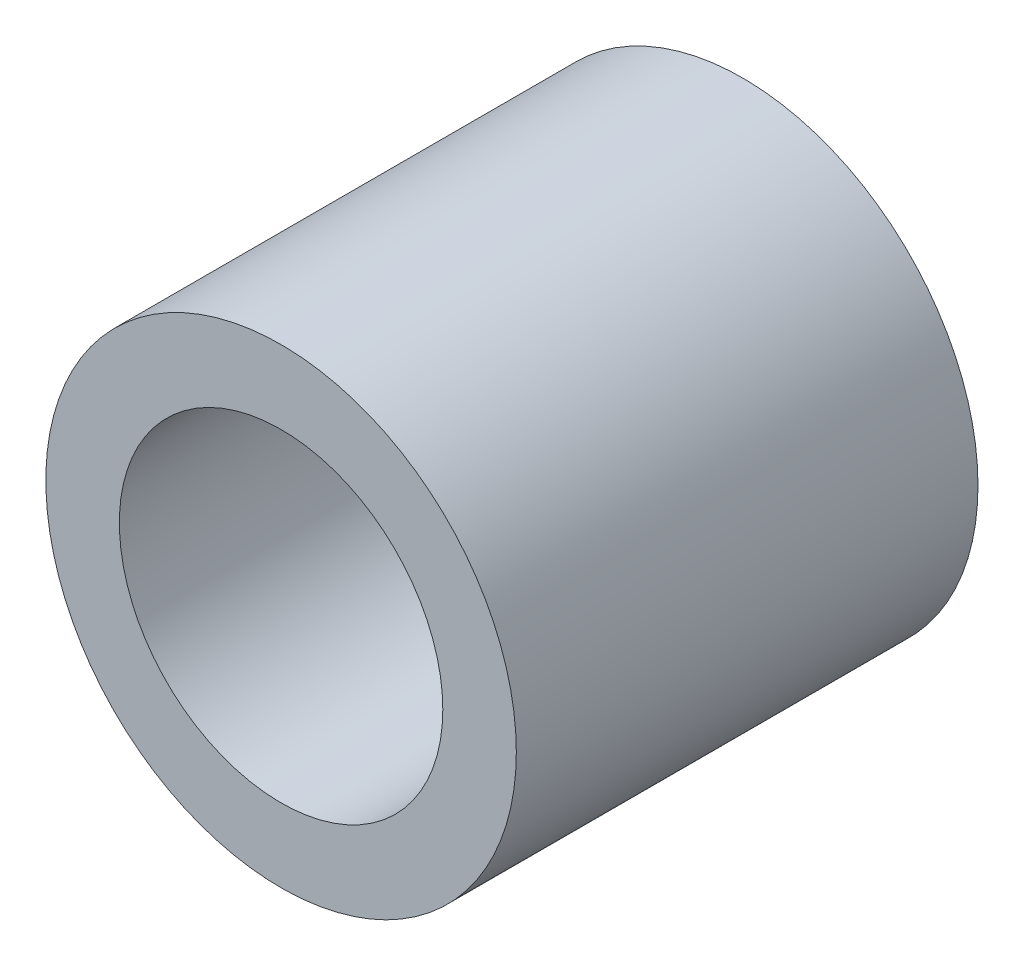
ISO-10303-21;
HEADER;
FILE_DESCRIPTION(('STEP AP214'),'2;1');
FILE_NAME('part.step','',(''),(''),'','','');
FILE_SCHEMA(('AUTOMOTIVE_DESIGN { 1 0 10303 214 1 1 1 1 }'));
ENDSEC;
DATA;
#1=APPLICATION_CONTEXT('core data for automotive mechanical design processes');
#2=APPLICATION_PROTOCOL_DEFINITION('international standard','automotive_design',2000,#1);
#3=PRODUCT_CONTEXT('',#1,'mechanical');
#4=PRODUCT('Part','Part','',(#3));
#5=PRODUCT_RELATED_PRODUCT_CATEGORY('part','',(#4));
#6=PRODUCT_DEFINITION_FORMATION('','',#4);
#7=PRODUCT_DEFINITION_CONTEXT('part definition',#1,'design');
#8=PRODUCT_DEFINITION('design','',#6,#7);
#9=PRODUCT_DEFINITION_SHAPE('','',#8);
#10=(LENGTH_UNIT() NAMED_UNIT(*) SI_UNIT(.MILLI.,.METRE.));
#11=(NAMED_UNIT(*) PLANE_ANGLE_UNIT() SI_UNIT($,.RADIAN.));
#12=(NAMED_UNIT(*) SI_UNIT($,.STERADIAN.) SOLID_ANGLE_UNIT());
#13=UNCERTAINTY_MEASURE_WITH_UNIT(LENGTH_MEASURE(1.E-05),#10,'distance_accuracy_value','');
#14=(GEOMETRIC_REPRESENTATION_CONTEXT(3) GLOBAL_UNCERTAINTY_ASSIGNED_CONTEXT((#13)) GLOBAL_UNIT_ASSIGNED_CONTEXT((#10,
#11,#12)) REPRESENTATION_CONTEXT('',''));
#15=CARTESIAN_POINT('',(0.,0.,0.));
#16=DIRECTION('',(0.,0.,1.));
#17=DIRECTION('',(1.,0.,0.));
#18=AXIS2_PLACEMENT_3D('',#15,#16,#17);
#19=CARTESIAN_POINT('',(0.,0.,7.85));
#20=DIRECTION('',(0.,0.,1.));
#21=DIRECTION('',(1.,0.,0.));
#22=AXIS2_PLACEMENT_3D('',#19,#20,#21);
#23=PLANE('',#22);
#24=CARTESIAN_POINT('',(0.,0.,7.85));
#25=DIRECTION('',(0.,0.,1.));
#26=DIRECTION('',(1.,0.,0.));
#27=AXIS2_PLACEMENT_3D('',#24,#25,#26);
#28=CIRCLE('',#27,4.);
#29=CARTESIAN_POINT('',(4.,0.,7.85));
#30=VERTEX_POINT('',#29);
#31=EDGE_CURVE('E10',#30,#30,#28,.T.);
#32=ORIENTED_EDGE('',*,*,#31,.T.);
#33=EDGE_LOOP('',(#32));
#34=FACE_BOUND('',#33,.T.);
#35=CARTESIAN_POINT('',(0.,0.,7.85));
#36=DIRECTION('',(0.,0.,1.));
#37=DIRECTION('',(1.,0.,0.));
#38=AXIS2_PLACEMENT_3D('',#35,#36,#37);
#39=CIRCLE('',#38,2.75);
#40=CARTESIAN_POINT('',(2.75,0.,7.85));
#41=VERTEX_POINT('',#40);
#42=EDGE_CURVE('E43',#41,#41,#39,.T.);
#43=ORIENTED_EDGE('',*,*,#42,.F.);
#44=EDGE_LOOP('',(#43));
#45=FACE_BOUND('',#44,.T.);
#46=ADVANCED_FACE('F32',(#34,#45),#23,.T.);
#47=CARTESIAN_POINT('',(0.,0.,0.));
#48=DIRECTION('',(0.,0.,1.));
#49=DIRECTION('',(1.,0.,0.));
#50=AXIS2_PLACEMENT_3D('',#47,#48,#49);
#51=PLANE('',#50);
#52=CARTESIAN_POINT('',(0.,0.,0.));
#53=DIRECTION('',(0.,0.,1.));
#54=DIRECTION('',(1.,0.,0.));
#55=AXIS2_PLACEMENT_3D('',#52,#53,#54);
#56=CIRCLE('',#55,4.);
#57=CARTESIAN_POINT('',(4.,0.,0.));
#58=VERTEX_POINT('',#57);
#59=EDGE_CURVE('E36',#58,#58,#56,.T.);
#60=ORIENTED_EDGE('',*,*,#59,.F.);
#61=EDGE_LOOP('',(#60));
#62=FACE_BOUND('',#61,.T.);
#63=CARTESIAN_POINT('',(0.,0.,0.));
#64=DIRECTION('',(0.,0.,1.));
#65=DIRECTION('',(1.,0.,0.));
#66=AXIS2_PLACEMENT_3D('',#63,#64,#65);
#67=CIRCLE('',#66,2.75);
#68=CARTESIAN_POINT('',(2.75,0.,0.));
#69=VERTEX_POINT('',#68);
#70=EDGE_CURVE('E45',#69,#69,#67,.T.);
#71=ORIENTED_EDGE('',*,*,#70,.T.);
#72=EDGE_LOOP('',(#71));
#73=FACE_BOUND('',#72,.T.);
#74=ADVANCED_FACE('F55',(#62,#73),#51,.F.);
#75=CARTESIAN_POINT('',(0.,0.,7.85));
#76=DIRECTION('',(0.,0.,-1.));
#77=DIRECTION('',(-1.,0.,0.));
#78=AXIS2_PLACEMENT_3D('',#75,#76,#77);
#79=CYLINDRICAL_SURFACE('',#78,4.);
#80=ORIENTED_EDGE('',*,*,#31,.F.);
#81=EDGE_LOOP('',(#80));
#82=FACE_BOUND('',#81,.T.);
#83=ORIENTED_EDGE('',*,*,#59,.T.);
#84=EDGE_LOOP('',(#83));
#85=FACE_BOUND('',#84,.T.);
#86=ADVANCED_FACE('F34',(#82,#85),#79,.T.);
#87=CARTESIAN_POINT('',(0.,0.,7.85));
#88=DIRECTION('',(0.,0.,-1.));
#89=DIRECTION('',(-1.,0.,0.));
#90=AXIS2_PLACEMENT_3D('',#87,#88,#89);
#91=CYLINDRICAL_SURFACE('',#90,2.75);
#92=ORIENTED_EDGE('',*,*,#42,.T.);
#93=EDGE_LOOP('',(#92));
#94=FACE_BOUND('',#93,.T.);
#95=ORIENTED_EDGE('',*,*,#70,.F.);
#96=EDGE_LOOP('',(#95));
#97=FACE_BOUND('',#96,.T.);
#98=ADVANCED_FACE('F51',(#94,#97),#91,.F.);
#99=CLOSED_SHELL('',(#46,#74,#86,#98));
#100=MANIFOLD_SOLID_BREP('B2',#99);
#101=ADVANCED_BREP_SHAPE_REPRESENTATION('',(#18,#100),#14);
#102=SHAPE_DEFINITION_REPRESENTATION(#9,#101);
ENDSEC;
END-ISO-10303-21;
